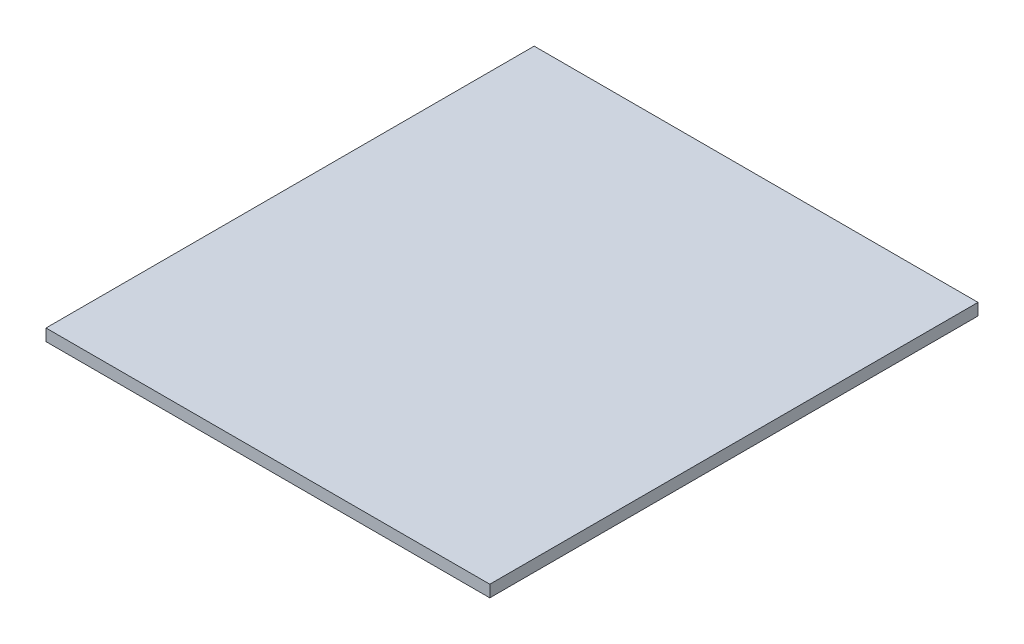
ISO-10303-21;
HEADER;
FILE_DESCRIPTION(('STEP AP214'),'2;1');
FILE_NAME('part.step','',(''),(''),'','','');
FILE_SCHEMA(('AUTOMOTIVE_DESIGN { 1 0 10303 214 1 1 1 1 }'));
ENDSEC;
DATA;
#1=APPLICATION_CONTEXT('core data for automotive mechanical design processes');
#2=APPLICATION_PROTOCOL_DEFINITION('international standard','automotive_design',2000,#1);
#3=PRODUCT_CONTEXT('',#1,'mechanical');
#4=PRODUCT('Part','Part','',(#3));
#5=PRODUCT_RELATED_PRODUCT_CATEGORY('part','',(#4));
#6=PRODUCT_DEFINITION_FORMATION('','',#4);
#7=PRODUCT_DEFINITION_CONTEXT('part definition',#1,'design');
#8=PRODUCT_DEFINITION('design','',#6,#7);
#9=PRODUCT_DEFINITION_SHAPE('','',#8);
#10=(LENGTH_UNIT() NAMED_UNIT(*) SI_UNIT(.MILLI.,.METRE.));
#11=(NAMED_UNIT(*) PLANE_ANGLE_UNIT() SI_UNIT($,.RADIAN.));
#12=(NAMED_UNIT(*) SI_UNIT($,.STERADIAN.) SOLID_ANGLE_UNIT());
#13=UNCERTAINTY_MEASURE_WITH_UNIT(LENGTH_MEASURE(1.E-05),#10,'distance_accuracy_value','');
#14=(GEOMETRIC_REPRESENTATION_CONTEXT(3) GLOBAL_UNCERTAINTY_ASSIGNED_CONTEXT((#13)) GLOBAL_UNIT_ASSIGNED_CONTEXT((#10,
#11,#12)) REPRESENTATION_CONTEXT('',''));
#15=CARTESIAN_POINT('',(0.,0.,0.));
#16=DIRECTION('',(0.,0.,1.));
#17=DIRECTION('',(1.,0.,0.));
#18=AXIS2_PLACEMENT_3D('',#15,#16,#17);
#19=CARTESIAN_POINT('',(50.0000000000001,4.,0.));
#20=DIRECTION('',(-1.,0.,0.));
#21=DIRECTION('',(0.,0.,1.));
#22=AXIS2_PLACEMENT_3D('',#19,#20,#21);
#23=PLANE('',#22);
#24=DIRECTION('',(0.,1.,0.));
#25=VECTOR('',#24,1.);
#26=CARTESIAN_POINT('',(50.0000000000001,4.,-675.));
#27=LINE('',#26,#25);
#28=CARTESIAN_POINT('',(50.0000000000001,4.,-675.));
#29=VERTEX_POINT('',#28);
#30=CARTESIAN_POINT('',(50.0000000000001,8.,-675.));
#31=VERTEX_POINT('',#30);
#32=EDGE_CURVE('E11',#29,#31,#27,.T.);
#33=ORIENTED_EDGE('',*,*,#32,.F.);
#34=DIRECTION('',(0.,0.,1.));
#35=VECTOR('',#34,1.);
#36=CARTESIAN_POINT('',(50.0000000000001,4.,0.));
#37=LINE('',#36,#35);
#38=CARTESIAN_POINT('',(50.,4.,-510.));
#39=VERTEX_POINT('',#38);
#40=EDGE_CURVE('E89',#29,#39,#37,.T.);
#41=ORIENTED_EDGE('',*,*,#40,.T.);
#42=DIRECTION('',(0.,1.,0.));
#43=VECTOR('',#42,1.);
#44=CARTESIAN_POINT('',(50.,4.,-510.));
#45=LINE('',#44,#43);
#46=CARTESIAN_POINT('',(50.,8.,-510.));
#47=VERTEX_POINT('',#46);
#48=EDGE_CURVE('E44',#39,#47,#45,.T.);
#49=ORIENTED_EDGE('',*,*,#48,.T.);
#50=DIRECTION('',(0.,0.,1.));
#51=VECTOR('',#50,1.);
#52=CARTESIAN_POINT('',(50.0000000000001,8.,0.));
#53=LINE('',#52,#51);
#54=EDGE_CURVE('E102',#31,#47,#53,.T.);
#55=ORIENTED_EDGE('',*,*,#54,.F.);
#56=EDGE_LOOP('',(#33,#41,#49,#55));
#57=FACE_BOUND('',#56,.T.);
#58=ADVANCED_FACE('F34',(#57),#23,.T.);
#59=CARTESIAN_POINT('',(0.,4.,-510.));
#60=DIRECTION('',(0.,0.,1.));
#61=DIRECTION('',(1.,0.,0.));
#62=AXIS2_PLACEMENT_3D('',#59,#60,#61);
#63=PLANE('',#62);
#64=ORIENTED_EDGE('',*,*,#48,.F.);
#65=DIRECTION('',(1.,0.,0.));
#66=VECTOR('',#65,1.);
#67=CARTESIAN_POINT('',(0.,4.,-510.));
#68=LINE('',#67,#66);
#69=CARTESIAN_POINT('',(200.,4.,-510.));
#70=VERTEX_POINT('',#69);
#71=EDGE_CURVE('E96',#70,#39,#68,.F.);
#72=ORIENTED_EDGE('',*,*,#71,.F.);
#73=DIRECTION('',(0.,1.,0.));
#74=VECTOR('',#73,1.);
#75=CARTESIAN_POINT('',(200.,4.,-510.));
#76=LINE('',#75,#74);
#77=CARTESIAN_POINT('',(200.,8.,-510.));
#78=VERTEX_POINT('',#77);
#79=EDGE_CURVE('E52',#70,#78,#76,.T.);
#80=ORIENTED_EDGE('',*,*,#79,.T.);
#81=DIRECTION('',(1.,0.,0.));
#82=VECTOR('',#81,1.);
#83=CARTESIAN_POINT('',(0.,8.,-510.));
#84=LINE('',#83,#82);
#85=EDGE_CURVE('E83',#78,#47,#84,.F.);
#86=ORIENTED_EDGE('',*,*,#85,.T.);
#87=EDGE_LOOP('',(#64,#72,#80,#86));
#88=FACE_BOUND('',#87,.T.);
#89=ADVANCED_FACE('F106',(#88),#63,.T.);
#90=CARTESIAN_POINT('',(200.,4.,0.));
#91=DIRECTION('',(-1.,0.,0.));
#92=DIRECTION('',(0.,0.,1.));
#93=AXIS2_PLACEMENT_3D('',#90,#91,#92);
#94=PLANE('',#93);
#95=ORIENTED_EDGE('',*,*,#79,.F.);
#96=DIRECTION('',(0.,0.,1.));
#97=VECTOR('',#96,1.);
#98=CARTESIAN_POINT('',(200.,4.,0.));
#99=LINE('',#98,#97);
#100=CARTESIAN_POINT('',(200.,4.,-675.));
#101=VERTEX_POINT('',#100);
#102=EDGE_CURVE('E88',#101,#70,#99,.T.);
#103=ORIENTED_EDGE('',*,*,#102,.F.);
#104=DIRECTION('',(0.,1.,0.));
#105=VECTOR('',#104,1.);
#106=CARTESIAN_POINT('',(200.,4.,-675.));
#107=LINE('',#106,#105);
#108=CARTESIAN_POINT('',(200.,8.,-675.));
#109=VERTEX_POINT('',#108);
#110=EDGE_CURVE('E38',#101,#109,#107,.T.);
#111=ORIENTED_EDGE('',*,*,#110,.T.);
#112=DIRECTION('',(0.,0.,1.));
#113=VECTOR('',#112,1.);
#114=CARTESIAN_POINT('',(200.,8.,0.));
#115=LINE('',#114,#113);
#116=EDGE_CURVE('E98',#109,#78,#115,.T.);
#117=ORIENTED_EDGE('',*,*,#116,.T.);
#118=EDGE_LOOP('',(#95,#103,#111,#117));
#119=FACE_BOUND('',#118,.T.);
#120=ADVANCED_FACE('F91',(#119),#94,.F.);
#121=CARTESIAN_POINT('',(0.,4.,-675.));
#122=DIRECTION('',(0.,0.,1.));
#123=DIRECTION('',(1.,0.,0.));
#124=AXIS2_PLACEMENT_3D('',#121,#122,#123);
#125=PLANE('',#124);
#126=DIRECTION('',(1.,0.,0.));
#127=VECTOR('',#126,1.);
#128=CARTESIAN_POINT('',(0.,4.,-675.));
#129=LINE('',#128,#127);
#130=EDGE_CURVE('E77',#29,#101,#129,.T.);
#131=ORIENTED_EDGE('',*,*,#130,.F.);
#132=ORIENTED_EDGE('',*,*,#32,.T.);
#133=DIRECTION('',(1.,0.,0.));
#134=VECTOR('',#133,1.);
#135=CARTESIAN_POINT('',(0.,8.,-675.));
#136=LINE('',#135,#134);
#137=EDGE_CURVE('E79',#31,#109,#136,.T.);
#138=ORIENTED_EDGE('',*,*,#137,.T.);
#139=ORIENTED_EDGE('',*,*,#110,.F.);
#140=EDGE_LOOP('',(#131,#132,#138,#139));
#141=FACE_BOUND('',#140,.T.);
#142=ADVANCED_FACE('F36',(#141),#125,.F.);
#143=CARTESIAN_POINT('',(0.,8.,0.));
#144=DIRECTION('',(0.,1.,0.));
#145=DIRECTION('',(0.,0.,1.));
#146=AXIS2_PLACEMENT_3D('',#143,#144,#145);
#147=PLANE('',#146);
#148=ORIENTED_EDGE('',*,*,#116,.F.);
#149=ORIENTED_EDGE('',*,*,#137,.F.);
#150=ORIENTED_EDGE('',*,*,#54,.T.);
#151=ORIENTED_EDGE('',*,*,#85,.F.);
#152=EDGE_LOOP('',(#148,#149,#150,#151));
#153=FACE_BOUND('',#152,.T.);
#154=ADVANCED_FACE('F105',(#153),#147,.T.);
#155=CARTESIAN_POINT('',(0.,4.,0.));
#156=DIRECTION('',(0.,1.,0.));
#157=DIRECTION('',(0.,0.,1.));
#158=AXIS2_PLACEMENT_3D('',#155,#156,#157);
#159=PLANE('',#158);
#160=ORIENTED_EDGE('',*,*,#102,.T.);
#161=ORIENTED_EDGE('',*,*,#71,.T.);
#162=ORIENTED_EDGE('',*,*,#40,.F.);
#163=ORIENTED_EDGE('',*,*,#130,.T.);
#164=EDGE_LOOP('',(#160,#161,#162,#163));
#165=FACE_BOUND('',#164,.T.);
#166=ADVANCED_FACE('F86',(#165),#159,.F.);
#167=CLOSED_SHELL('',(#58,#89,#120,#142,#154,#166));
#168=MANIFOLD_SOLID_BREP('B2',#167);
#169=ADVANCED_BREP_SHAPE_REPRESENTATION('',(#18,#168),#14);
#170=SHAPE_DEFINITION_REPRESENTATION(#9,#169);
ENDSEC;
END-ISO-10303-21;
